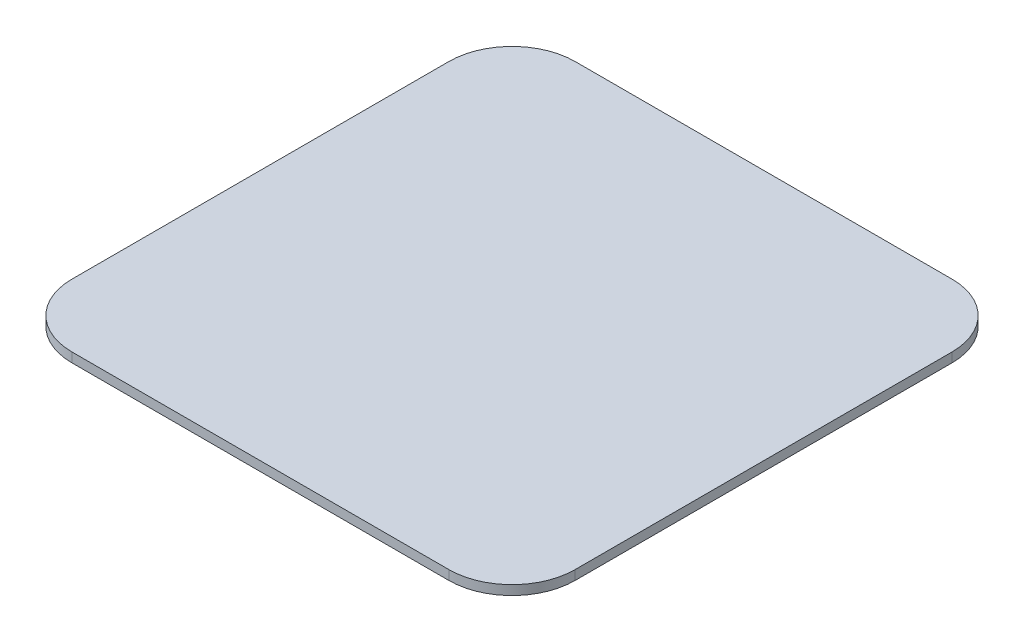
ISO-10303-21;
HEADER;
FILE_DESCRIPTION(('STEP AP214'),'2;1');
FILE_NAME('part.step','',(''),(''),'','','');
FILE_SCHEMA(('AUTOMOTIVE_DESIGN { 1 0 10303 214 1 1 1 1 }'));
ENDSEC;
DATA;
#1=APPLICATION_CONTEXT('core data for automotive mechanical design processes');
#2=APPLICATION_PROTOCOL_DEFINITION('international standard','automotive_design',2000,#1);
#3=PRODUCT_CONTEXT('',#1,'mechanical');
#4=PRODUCT('Part','Part','',(#3));
#5=PRODUCT_RELATED_PRODUCT_CATEGORY('part','',(#4));
#6=PRODUCT_DEFINITION_FORMATION('','',#4);
#7=PRODUCT_DEFINITION_CONTEXT('part definition',#1,'design');
#8=PRODUCT_DEFINITION('design','',#6,#7);
#9=PRODUCT_DEFINITION_SHAPE('','',#8);
#10=(LENGTH_UNIT() NAMED_UNIT(*) SI_UNIT(.MILLI.,.METRE.));
#11=(NAMED_UNIT(*) PLANE_ANGLE_UNIT() SI_UNIT($,.RADIAN.));
#12=(NAMED_UNIT(*) SI_UNIT($,.STERADIAN.) SOLID_ANGLE_UNIT());
#13=UNCERTAINTY_MEASURE_WITH_UNIT(LENGTH_MEASURE(1.E-05),#10,'distance_accuracy_value','');
#14=(GEOMETRIC_REPRESENTATION_CONTEXT(3) GLOBAL_UNCERTAINTY_ASSIGNED_CONTEXT((#13)) GLOBAL_UNIT_ASSIGNED_CONTEXT((#10,
#11,#12)) REPRESENTATION_CONTEXT('',''));
#15=CARTESIAN_POINT('',(0.,0.,0.));
#16=DIRECTION('',(0.,0.,1.));
#17=DIRECTION('',(1.,0.,0.));
#18=AXIS2_PLACEMENT_3D('',#15,#16,#17);
#19=CARTESIAN_POINT('',(-79.75,3.,79.75));
#20=DIRECTION('',(1.,0.,0.));
#21=DIRECTION('',(0.,0.,-1.));
#22=AXIS2_PLACEMENT_3D('',#19,#20,#21);
#23=PLANE('',#22);
#24=DIRECTION('',(0.,0.,1.));
#25=VECTOR('',#24,1.);
#26=CARTESIAN_POINT('',(-79.75,3.,79.75));
#27=LINE('',#26,#25);
#28=CARTESIAN_POINT('',(-79.75,3.,-59.75));
#29=VERTEX_POINT('',#28);
#30=CARTESIAN_POINT('',(-79.75,3.,59.75));
#31=VERTEX_POINT('',#30);
#32=EDGE_CURVE('E118',#29,#31,#27,.T.);
#33=ORIENTED_EDGE('',*,*,#32,.F.);
#34=DIRECTION('',(0.,-1.,0.));
#35=VECTOR('',#34,1.);
#36=CARTESIAN_POINT('',(-79.75,3.,-59.75));
#37=LINE('',#36,#35);
#38=CARTESIAN_POINT('',(-79.75,0.,-59.75));
#39=VERTEX_POINT('',#38);
#40=EDGE_CURVE('E103',#29,#39,#37,.T.);
#41=ORIENTED_EDGE('',*,*,#40,.T.);
#42=DIRECTION('',(0.,0.,1.));
#43=VECTOR('',#42,1.);
#44=CARTESIAN_POINT('',(-79.75,0.,79.75));
#45=LINE('',#44,#43);
#46=CARTESIAN_POINT('',(-79.75,0.,59.75));
#47=VERTEX_POINT('',#46);
#48=EDGE_CURVE('E115',#39,#47,#45,.T.);
#49=ORIENTED_EDGE('',*,*,#48,.T.);
#50=DIRECTION('',(0.,-1.,0.));
#51=VECTOR('',#50,1.);
#52=CARTESIAN_POINT('',(-79.75,3.,59.75));
#53=LINE('',#52,#51);
#54=EDGE_CURVE('E120',#47,#31,#53,.F.);
#55=ORIENTED_EDGE('',*,*,#54,.T.);
#56=EDGE_LOOP('',(#33,#41,#49,#55));
#57=FACE_BOUND('',#56,.T.);
#58=ADVANCED_FACE('F33',(#57),#23,.F.);
#59=CARTESIAN_POINT('',(79.75,3.,79.75));
#60=DIRECTION('',(0.,0.,-1.));
#61=DIRECTION('',(-1.,0.,0.));
#62=AXIS2_PLACEMENT_3D('',#59,#60,#61);
#63=PLANE('',#62);
#64=DIRECTION('',(1.,0.,0.));
#65=VECTOR('',#64,1.);
#66=CARTESIAN_POINT('',(79.75,0.,79.75));
#67=LINE('',#66,#65);
#68=CARTESIAN_POINT('',(-59.75,0.,79.75));
#69=VERTEX_POINT('',#68);
#70=CARTESIAN_POINT('',(59.75,0.,79.75));
#71=VERTEX_POINT('',#70);
#72=EDGE_CURVE('E124',#69,#71,#67,.T.);
#73=ORIENTED_EDGE('',*,*,#72,.T.);
#74=DIRECTION('',(0.,-1.,0.));
#75=VECTOR('',#74,1.);
#76=CARTESIAN_POINT('',(59.75,3.,79.75));
#77=LINE('',#76,#75);
#78=CARTESIAN_POINT('',(59.75,3.,79.75));
#79=VERTEX_POINT('',#78);
#80=EDGE_CURVE('E11',#71,#79,#77,.F.);
#81=ORIENTED_EDGE('',*,*,#80,.T.);
#82=DIRECTION('',(1.,0.,0.));
#83=VECTOR('',#82,1.);
#84=CARTESIAN_POINT('',(79.75,3.,79.75));
#85=LINE('',#84,#83);
#86=CARTESIAN_POINT('',(-59.75,3.,79.75));
#87=VERTEX_POINT('',#86);
#88=EDGE_CURVE('E160',#87,#79,#85,.T.);
#89=ORIENTED_EDGE('',*,*,#88,.F.);
#90=DIRECTION('',(0.,-1.,0.));
#91=VECTOR('',#90,1.);
#92=CARTESIAN_POINT('',(-59.75,3.,79.75));
#93=LINE('',#92,#91);
#94=EDGE_CURVE('E41',#87,#69,#93,.T.);
#95=ORIENTED_EDGE('',*,*,#94,.T.);
#96=EDGE_LOOP('',(#73,#81,#89,#95));
#97=FACE_BOUND('',#96,.T.);
#98=ADVANCED_FACE('F158',(#97),#63,.F.);
#99=CARTESIAN_POINT('',(79.75,3.,79.75));
#100=DIRECTION('',(-1.,0.,0.));
#101=DIRECTION('',(0.,0.,1.));
#102=AXIS2_PLACEMENT_3D('',#99,#100,#101);
#103=PLANE('',#102);
#104=DIRECTION('',(0.,0.,-1.));
#105=VECTOR('',#104,1.);
#106=CARTESIAN_POINT('',(79.75,0.,79.75));
#107=LINE('',#106,#105);
#108=CARTESIAN_POINT('',(79.75,0.,59.75));
#109=VERTEX_POINT('',#108);
#110=CARTESIAN_POINT('',(79.75,0.,-59.75));
#111=VERTEX_POINT('',#110);
#112=EDGE_CURVE('E127',#109,#111,#107,.T.);
#113=ORIENTED_EDGE('',*,*,#112,.T.);
#114=DIRECTION('',(0.,-1.,0.));
#115=VECTOR('',#114,1.);
#116=CARTESIAN_POINT('',(79.75,3.,-59.75));
#117=LINE('',#116,#115);
#118=CARTESIAN_POINT('',(79.75,3.,-59.75));
#119=VERTEX_POINT('',#118);
#120=EDGE_CURVE('E48',#111,#119,#117,.F.);
#121=ORIENTED_EDGE('',*,*,#120,.T.);
#122=DIRECTION('',(0.,0.,-1.));
#123=VECTOR('',#122,1.);
#124=CARTESIAN_POINT('',(79.75,3.,79.75));
#125=LINE('',#124,#123);
#126=CARTESIAN_POINT('',(79.75,3.,59.75));
#127=VERTEX_POINT('',#126);
#128=EDGE_CURVE('E168',#127,#119,#125,.T.);
#129=ORIENTED_EDGE('',*,*,#128,.F.);
#130=DIRECTION('',(0.,-1.,0.));
#131=VECTOR('',#130,1.);
#132=CARTESIAN_POINT('',(79.75,3.,59.75));
#133=LINE('',#132,#131);
#134=EDGE_CURVE('E151',#127,#109,#133,.T.);
#135=ORIENTED_EDGE('',*,*,#134,.T.);
#136=EDGE_LOOP('',(#113,#121,#129,#135));
#137=FACE_BOUND('',#136,.T.);
#138=ADVANCED_FACE('F167',(#137),#103,.F.);
#139=CARTESIAN_POINT('',(79.75,3.,-79.75));
#140=DIRECTION('',(0.,0.,1.));
#141=DIRECTION('',(1.,0.,0.));
#142=AXIS2_PLACEMENT_3D('',#139,#140,#141);
#143=PLANE('',#142);
#144=DIRECTION('',(-1.,0.,0.));
#145=VECTOR('',#144,1.);
#146=CARTESIAN_POINT('',(79.75,0.,-79.75));
#147=LINE('',#146,#145);
#148=CARTESIAN_POINT('',(59.75,0.,-79.75));
#149=VERTEX_POINT('',#148);
#150=CARTESIAN_POINT('',(-59.75,0.,-79.75));
#151=VERTEX_POINT('',#150);
#152=EDGE_CURVE('E134',#149,#151,#147,.T.);
#153=ORIENTED_EDGE('',*,*,#152,.T.);
#154=DIRECTION('',(0.,-1.,0.));
#155=VECTOR('',#154,1.);
#156=CARTESIAN_POINT('',(-59.75,3.,-79.75));
#157=LINE('',#156,#155);
#158=CARTESIAN_POINT('',(-59.75,3.,-79.75));
#159=VERTEX_POINT('',#158);
#160=EDGE_CURVE('E104',#151,#159,#157,.F.);
#161=ORIENTED_EDGE('',*,*,#160,.T.);
#162=DIRECTION('',(-1.,0.,0.));
#163=VECTOR('',#162,1.);
#164=CARTESIAN_POINT('',(79.75,3.,-79.75));
#165=LINE('',#164,#163);
#166=CARTESIAN_POINT('',(59.75,3.,-79.75));
#167=VERTEX_POINT('',#166);
#168=EDGE_CURVE('E130',#167,#159,#165,.T.);
#169=ORIENTED_EDGE('',*,*,#168,.F.);
#170=DIRECTION('',(0.,-1.,0.));
#171=VECTOR('',#170,1.);
#172=CARTESIAN_POINT('',(59.75,3.,-79.75));
#173=LINE('',#172,#171);
#174=EDGE_CURVE('E109',#167,#149,#173,.T.);
#175=ORIENTED_EDGE('',*,*,#174,.T.);
#176=EDGE_LOOP('',(#153,#161,#169,#175));
#177=FACE_BOUND('',#176,.T.);
#178=ADVANCED_FACE('F196',(#177),#143,.F.);
#179=CARTESIAN_POINT('',(0.,3.,0.));
#180=DIRECTION('',(0.,1.,0.));
#181=DIRECTION('',(0.,0.,1.));
#182=AXIS2_PLACEMENT_3D('',#179,#180,#181);
#183=PLANE('',#182);
#184=ORIENTED_EDGE('',*,*,#168,.T.);
#185=CARTESIAN_POINT('',(-59.75,3.,-59.75));
#186=DIRECTION('',(0.,1.,0.));
#187=DIRECTION('',(0.,0.,1.));
#188=AXIS2_PLACEMENT_3D('',#185,#186,#187);
#189=CIRCLE('',#188,20.);
#190=EDGE_CURVE('E149',#159,#29,#189,.T.);
#191=ORIENTED_EDGE('',*,*,#190,.T.);
#192=ORIENTED_EDGE('',*,*,#32,.T.);
#193=CARTESIAN_POINT('',(-59.75,3.,59.75));
#194=DIRECTION('',(0.,1.,0.));
#195=DIRECTION('',(0.,0.,1.));
#196=AXIS2_PLACEMENT_3D('',#193,#194,#195);
#197=CIRCLE('',#196,20.);
#198=EDGE_CURVE('E144',#31,#87,#197,.T.);
#199=ORIENTED_EDGE('',*,*,#198,.T.);
#200=ORIENTED_EDGE('',*,*,#88,.T.);
#201=CARTESIAN_POINT('',(59.75,3.,59.75));
#202=DIRECTION('',(0.,1.,0.));
#203=DIRECTION('',(0.,0.,1.));
#204=AXIS2_PLACEMENT_3D('',#201,#202,#203);
#205=CIRCLE('',#204,20.);
#206=EDGE_CURVE('E55',#79,#127,#205,.T.);
#207=ORIENTED_EDGE('',*,*,#206,.T.);
#208=ORIENTED_EDGE('',*,*,#128,.T.);
#209=CARTESIAN_POINT('',(59.75,3.,-59.75));
#210=DIRECTION('',(0.,1.,0.));
#211=DIRECTION('',(0.,0.,1.));
#212=AXIS2_PLACEMENT_3D('',#209,#210,#211);
#213=CIRCLE('',#212,20.);
#214=EDGE_CURVE('E147',#119,#167,#213,.T.);
#215=ORIENTED_EDGE('',*,*,#214,.T.);
#216=EDGE_LOOP('',(#184,#191,#192,#199,#200,#207,#208,#215));
#217=FACE_BOUND('',#216,.T.);
#218=ADVANCED_FACE('F173',(#217),#183,.T.);
#219=CARTESIAN_POINT('',(0.,0.,0.));
#220=DIRECTION('',(0.,1.,0.));
#221=DIRECTION('',(0.,0.,1.));
#222=AXIS2_PLACEMENT_3D('',#219,#220,#221);
#223=PLANE('',#222);
#224=ORIENTED_EDGE('',*,*,#48,.F.);
#225=CARTESIAN_POINT('',(-59.75,0.,-59.75));
#226=DIRECTION('',(0.,1.,0.));
#227=DIRECTION('',(0.,0.,1.));
#228=AXIS2_PLACEMENT_3D('',#225,#226,#227);
#229=CIRCLE('',#228,20.);
#230=EDGE_CURVE('E99',#39,#151,#229,.F.);
#231=ORIENTED_EDGE('',*,*,#230,.T.);
#232=ORIENTED_EDGE('',*,*,#152,.F.);
#233=CARTESIAN_POINT('',(59.75,0.,-59.75));
#234=DIRECTION('',(0.,1.,0.));
#235=DIRECTION('',(0.,0.,1.));
#236=AXIS2_PLACEMENT_3D('',#233,#234,#235);
#237=CIRCLE('',#236,20.);
#238=EDGE_CURVE('E110',#149,#111,#237,.F.);
#239=ORIENTED_EDGE('',*,*,#238,.T.);
#240=ORIENTED_EDGE('',*,*,#112,.F.);
#241=CARTESIAN_POINT('',(59.75,0.,59.75));
#242=DIRECTION('',(0.,1.,0.));
#243=DIRECTION('',(0.,0.,1.));
#244=AXIS2_PLACEMENT_3D('',#241,#242,#243);
#245=CIRCLE('',#244,20.);
#246=EDGE_CURVE('E138',#109,#71,#245,.F.);
#247=ORIENTED_EDGE('',*,*,#246,.T.);
#248=ORIENTED_EDGE('',*,*,#72,.F.);
#249=CARTESIAN_POINT('',(-59.75,0.,59.75));
#250=DIRECTION('',(0.,1.,0.));
#251=DIRECTION('',(0.,0.,1.));
#252=AXIS2_PLACEMENT_3D('',#249,#250,#251);
#253=CIRCLE('',#252,20.);
#254=EDGE_CURVE('E119',#69,#47,#253,.F.);
#255=ORIENTED_EDGE('',*,*,#254,.T.);
#256=EDGE_LOOP('',(#224,#231,#232,#239,#240,#247,#248,#255));
#257=FACE_BOUND('',#256,.T.);
#258=ADVANCED_FACE('F122',(#257),#223,.F.);
#259=CARTESIAN_POINT('',(-59.75,3.,-59.75));
#260=DIRECTION('',(0.,-1.,0.));
#261=DIRECTION('',(0.,0.,-1.));
#262=AXIS2_PLACEMENT_3D('',#259,#260,#261);
#263=CYLINDRICAL_SURFACE('',#262,20.);
#264=ORIENTED_EDGE('',*,*,#190,.F.);
#265=ORIENTED_EDGE('',*,*,#160,.F.);
#266=ORIENTED_EDGE('',*,*,#230,.F.);
#267=ORIENTED_EDGE('',*,*,#40,.F.);
#268=EDGE_LOOP('',(#264,#265,#266,#267));
#269=FACE_BOUND('',#268,.T.);
#270=ADVANCED_FACE('F102',(#269),#263,.T.);
#271=CARTESIAN_POINT('',(59.75,3.,-59.75));
#272=DIRECTION('',(0.,-1.,0.));
#273=DIRECTION('',(0.,0.,-1.));
#274=AXIS2_PLACEMENT_3D('',#271,#272,#273);
#275=CYLINDRICAL_SURFACE('',#274,20.);
#276=ORIENTED_EDGE('',*,*,#214,.F.);
#277=ORIENTED_EDGE('',*,*,#120,.F.);
#278=ORIENTED_EDGE('',*,*,#238,.F.);
#279=ORIENTED_EDGE('',*,*,#174,.F.);
#280=EDGE_LOOP('',(#276,#277,#278,#279));
#281=FACE_BOUND('',#280,.T.);
#282=ADVANCED_FACE('F178',(#281),#275,.T.);
#283=CARTESIAN_POINT('',(59.75,3.,59.75));
#284=DIRECTION('',(0.,-1.,0.));
#285=DIRECTION('',(0.,0.,-1.));
#286=AXIS2_PLACEMENT_3D('',#283,#284,#285);
#287=CYLINDRICAL_SURFACE('',#286,20.);
#288=ORIENTED_EDGE('',*,*,#206,.F.);
#289=ORIENTED_EDGE('',*,*,#80,.F.);
#290=ORIENTED_EDGE('',*,*,#246,.F.);
#291=ORIENTED_EDGE('',*,*,#134,.F.);
#292=EDGE_LOOP('',(#288,#289,#290,#291));
#293=FACE_BOUND('',#292,.T.);
#294=ADVANCED_FACE('F166',(#293),#287,.T.);
#295=CARTESIAN_POINT('',(-59.75,3.,59.75));
#296=DIRECTION('',(0.,-1.,0.));
#297=DIRECTION('',(0.,0.,-1.));
#298=AXIS2_PLACEMENT_3D('',#295,#296,#297);
#299=CYLINDRICAL_SURFACE('',#298,20.);
#300=ORIENTED_EDGE('',*,*,#198,.F.);
#301=ORIENTED_EDGE('',*,*,#54,.F.);
#302=ORIENTED_EDGE('',*,*,#254,.F.);
#303=ORIENTED_EDGE('',*,*,#94,.F.);
#304=EDGE_LOOP('',(#300,#301,#302,#303));
#305=FACE_BOUND('',#304,.T.);
#306=ADVANCED_FACE('F35',(#305),#299,.T.);
#307=CLOSED_SHELL('',(#58,#98,#138,#178,#218,#258,#270,#282,#294,#306));
#308=MANIFOLD_SOLID_BREP('B2',#307);
#309=ADVANCED_BREP_SHAPE_REPRESENTATION('',(#18,#308),#14);
#310=SHAPE_DEFINITION_REPRESENTATION(#9,#309);
ENDSEC;
END-ISO-10303-21;
